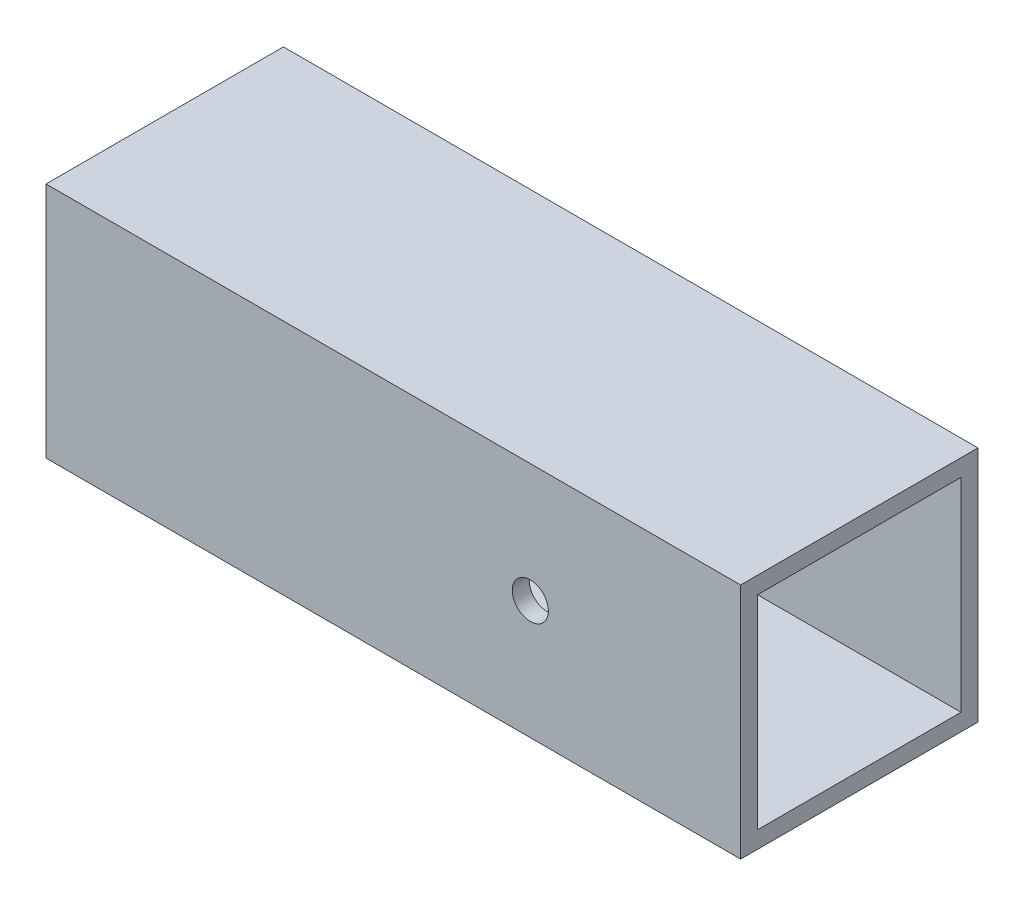
ISO-10303-21;
HEADER;
FILE_DESCRIPTION(('STEP AP214'),'2;1');
FILE_NAME('part.step','',(''),(''),'','','');
FILE_SCHEMA(('AUTOMOTIVE_DESIGN { 1 0 10303 214 1 1 1 1 }'));
ENDSEC;
DATA;
#1=APPLICATION_CONTEXT('core data for automotive mechanical design processes');
#2=APPLICATION_PROTOCOL_DEFINITION('international standard','automotive_design',2000,#1);
#3=PRODUCT_CONTEXT('',#1,'mechanical');
#4=PRODUCT('Part','Part','',(#3));
#5=PRODUCT_RELATED_PRODUCT_CATEGORY('part','',(#4));
#6=PRODUCT_DEFINITION_FORMATION('','',#4);
#7=PRODUCT_DEFINITION_CONTEXT('part definition',#1,'design');
#8=PRODUCT_DEFINITION('design','',#6,#7);
#9=PRODUCT_DEFINITION_SHAPE('','',#8);
#10=(LENGTH_UNIT() NAMED_UNIT(*) SI_UNIT(.MILLI.,.METRE.));
#11=(NAMED_UNIT(*) PLANE_ANGLE_UNIT() SI_UNIT($,.RADIAN.));
#12=(NAMED_UNIT(*) SI_UNIT($,.STERADIAN.) SOLID_ANGLE_UNIT());
#13=UNCERTAINTY_MEASURE_WITH_UNIT(LENGTH_MEASURE(1.E-05),#10,'distance_accuracy_value','');
#14=(GEOMETRIC_REPRESENTATION_CONTEXT(3) GLOBAL_UNCERTAINTY_ASSIGNED_CONTEXT((#13)) GLOBAL_UNIT_ASSIGNED_CONTEXT((#10,
#11,#12)) REPRESENTATION_CONTEXT('',''));
#15=CARTESIAN_POINT('',(0.,0.,0.));
#16=DIRECTION('',(0.,0.,1.));
#17=DIRECTION('',(1.,0.,0.));
#18=AXIS2_PLACEMENT_3D('',#15,#16,#17);
#19=CARTESIAN_POINT('',(130.048,0.,0.));
#20=DIRECTION('',(-1.,0.,0.));
#21=DIRECTION('',(0.,0.,1.));
#22=AXIS2_PLACEMENT_3D('',#19,#20,#21);
#23=PLANE('',#22);
#24=DIRECTION('',(0.,-1.,0.));
#25=VECTOR('',#24,1.);
#26=CARTESIAN_POINT('',(130.048,0.,0.));
#27=LINE('',#26,#25);
#28=CARTESIAN_POINT('',(130.048,44.45,0.));
#29=VERTEX_POINT('',#28);
#30=CARTESIAN_POINT('',(130.048,0.,0.));
#31=VERTEX_POINT('',#30);
#32=EDGE_CURVE('E138',#29,#31,#27,.T.);
#33=ORIENTED_EDGE('',*,*,#32,.T.);
#34=DIRECTION('',(0.,0.,-1.));
#35=VECTOR('',#34,1.);
#36=CARTESIAN_POINT('',(130.048,0.,0.));
#37=LINE('',#36,#35);
#38=CARTESIAN_POINT('',(130.048,0.,-44.45));
#39=VERTEX_POINT('',#38);
#40=EDGE_CURVE('E141',#31,#39,#37,.T.);
#41=ORIENTED_EDGE('',*,*,#40,.T.);
#42=DIRECTION('',(0.,1.,0.));
#43=VECTOR('',#42,1.);
#44=CARTESIAN_POINT('',(130.048,0.,-44.45));
#45=LINE('',#44,#43);
#46=CARTESIAN_POINT('',(130.048,44.45,-44.45));
#47=VERTEX_POINT('',#46);
#48=EDGE_CURVE('E144',#39,#47,#45,.T.);
#49=ORIENTED_EDGE('',*,*,#48,.T.);
#50=DIRECTION('',(0.,0.,1.));
#51=VECTOR('',#50,1.);
#52=CARTESIAN_POINT('',(130.048,44.45,0.));
#53=LINE('',#52,#51);
#54=EDGE_CURVE('E146',#47,#29,#53,.T.);
#55=ORIENTED_EDGE('',*,*,#54,.T.);
#56=EDGE_LOOP('',(#33,#41,#49,#55));
#57=FACE_BOUND('',#56,.T.);
#58=DIRECTION('',(0.,0.,-1.));
#59=VECTOR('',#58,1.);
#60=CARTESIAN_POINT('',(130.048,3.175,-3.175));
#61=LINE('',#60,#59);
#62=CARTESIAN_POINT('',(130.048,3.175,-3.175));
#63=VERTEX_POINT('',#62);
#64=CARTESIAN_POINT('',(130.048,3.175,-41.275));
#65=VERTEX_POINT('',#64);
#66=EDGE_CURVE('E100',#63,#65,#61,.T.);
#67=ORIENTED_EDGE('',*,*,#66,.F.);
#68=DIRECTION('',(0.,-1.,0.));
#69=VECTOR('',#68,1.);
#70=CARTESIAN_POINT('',(130.048,3.175,-3.175));
#71=LINE('',#70,#69);
#72=CARTESIAN_POINT('',(130.048,41.275,-3.175));
#73=VERTEX_POINT('',#72);
#74=EDGE_CURVE('E122',#73,#63,#71,.T.);
#75=ORIENTED_EDGE('',*,*,#74,.F.);
#76=DIRECTION('',(0.,0.,1.));
#77=VECTOR('',#76,1.);
#78=CARTESIAN_POINT('',(130.048,41.275,-3.175));
#79=LINE('',#78,#77);
#80=CARTESIAN_POINT('',(130.048,41.275,-41.275));
#81=VERTEX_POINT('',#80);
#82=EDGE_CURVE('E120',#81,#73,#79,.T.);
#83=ORIENTED_EDGE('',*,*,#82,.F.);
#84=DIRECTION('',(0.,1.,0.));
#85=VECTOR('',#84,1.);
#86=CARTESIAN_POINT('',(130.048,3.175,-41.275));
#87=LINE('',#86,#85);
#88=EDGE_CURVE('E108',#65,#81,#87,.T.);
#89=ORIENTED_EDGE('',*,*,#88,.F.);
#90=EDGE_LOOP('',(#67,#75,#83,#89));
#91=FACE_BOUND('',#90,.T.);
#92=ADVANCED_FACE('F34',(#57,#91),#23,.F.);
#93=CARTESIAN_POINT('',(0.,0.,0.));
#94=DIRECTION('',(-1.,0.,0.));
#95=DIRECTION('',(0.,0.,1.));
#96=AXIS2_PLACEMENT_3D('',#93,#94,#95);
#97=PLANE('',#96);
#98=DIRECTION('',(0.,-1.,0.));
#99=VECTOR('',#98,1.);
#100=CARTESIAN_POINT('',(0.,0.,0.));
#101=LINE('',#100,#99);
#102=CARTESIAN_POINT('',(0.,44.45,0.));
#103=VERTEX_POINT('',#102);
#104=CARTESIAN_POINT('',(0.,0.,0.));
#105=VERTEX_POINT('',#104);
#106=EDGE_CURVE('E116',#103,#105,#101,.T.);
#107=ORIENTED_EDGE('',*,*,#106,.F.);
#108=DIRECTION('',(0.,0.,1.));
#109=VECTOR('',#108,1.);
#110=CARTESIAN_POINT('',(0.,44.45,0.));
#111=LINE('',#110,#109);
#112=CARTESIAN_POINT('',(0.,44.45,-44.45));
#113=VERTEX_POINT('',#112);
#114=EDGE_CURVE('E142',#113,#103,#111,.T.);
#115=ORIENTED_EDGE('',*,*,#114,.F.);
#116=DIRECTION('',(0.,1.,0.));
#117=VECTOR('',#116,1.);
#118=CARTESIAN_POINT('',(0.,0.,-44.45));
#119=LINE('',#118,#117);
#120=CARTESIAN_POINT('',(0.,0.,-44.45));
#121=VERTEX_POINT('',#120);
#122=EDGE_CURVE('E153',#121,#113,#119,.T.);
#123=ORIENTED_EDGE('',*,*,#122,.F.);
#124=DIRECTION('',(0.,0.,-1.));
#125=VECTOR('',#124,1.);
#126=CARTESIAN_POINT('',(0.,0.,0.));
#127=LINE('',#126,#125);
#128=EDGE_CURVE('E151',#105,#121,#127,.T.);
#129=ORIENTED_EDGE('',*,*,#128,.F.);
#130=EDGE_LOOP('',(#107,#115,#123,#129));
#131=FACE_BOUND('',#130,.T.);
#132=DIRECTION('',(0.,-1.,0.));
#133=VECTOR('',#132,1.);
#134=CARTESIAN_POINT('',(0.,3.175,-3.175));
#135=LINE('',#134,#133);
#136=CARTESIAN_POINT('',(0.,41.275,-3.175));
#137=VERTEX_POINT('',#136);
#138=CARTESIAN_POINT('',(0.,3.175,-3.175));
#139=VERTEX_POINT('',#138);
#140=EDGE_CURVE('E109',#137,#139,#135,.T.);
#141=ORIENTED_EDGE('',*,*,#140,.T.);
#142=DIRECTION('',(0.,0.,-1.));
#143=VECTOR('',#142,1.);
#144=CARTESIAN_POINT('',(0.,3.175,-3.175));
#145=LINE('',#144,#143);
#146=CARTESIAN_POINT('',(0.,3.175,-41.275));
#147=VERTEX_POINT('',#146);
#148=EDGE_CURVE('E58',#139,#147,#145,.T.);
#149=ORIENTED_EDGE('',*,*,#148,.T.);
#150=DIRECTION('',(0.,1.,0.));
#151=VECTOR('',#150,1.);
#152=CARTESIAN_POINT('',(0.,3.175,-41.275));
#153=LINE('',#152,#151);
#154=CARTESIAN_POINT('',(0.,41.275,-41.275));
#155=VERTEX_POINT('',#154);
#156=EDGE_CURVE('E115',#147,#155,#153,.T.);
#157=ORIENTED_EDGE('',*,*,#156,.T.);
#158=DIRECTION('',(0.,0.,1.));
#159=VECTOR('',#158,1.);
#160=CARTESIAN_POINT('',(0.,41.275,-3.175));
#161=LINE('',#160,#159);
#162=EDGE_CURVE('E130',#155,#137,#161,.T.);
#163=ORIENTED_EDGE('',*,*,#162,.T.);
#164=EDGE_LOOP('',(#141,#149,#157,#163));
#165=FACE_BOUND('',#164,.T.);
#166=ADVANCED_FACE('F172',(#131,#165),#97,.T.);
#167=CARTESIAN_POINT('',(130.048,0.,0.));
#168=DIRECTION('',(0.,0.,-1.));
#169=DIRECTION('',(-1.,0.,0.));
#170=AXIS2_PLACEMENT_3D('',#167,#168,#169);
#171=PLANE('',#170);
#172=CARTESIAN_POINT('',(90.678,22.225,0.));
#173=DIRECTION('',(0.,0.,1.));
#174=DIRECTION('',(1.,0.,0.));
#175=AXIS2_PLACEMENT_3D('',#172,#173,#174);
#176=CIRCLE('',#175,3.37819999999998);
#177=CARTESIAN_POINT('',(94.0562,22.225,0.));
#178=VERTEX_POINT('',#177);
#179=EDGE_CURVE('E233',#178,#178,#176,.T.);
#180=ORIENTED_EDGE('',*,*,#179,.F.);
#181=EDGE_LOOP('',(#180));
#182=FACE_BOUND('',#181,.T.);
#183=ORIENTED_EDGE('',*,*,#106,.T.);
#184=DIRECTION('',(-1.,0.,0.));
#185=VECTOR('',#184,1.);
#186=CARTESIAN_POINT('',(130.048,0.,0.));
#187=LINE('',#186,#185);
#188=EDGE_CURVE('E11',#31,#105,#187,.T.);
#189=ORIENTED_EDGE('',*,*,#188,.F.);
#190=ORIENTED_EDGE('',*,*,#32,.F.);
#191=DIRECTION('',(-1.,0.,0.));
#192=VECTOR('',#191,1.);
#193=CARTESIAN_POINT('',(130.048,44.45,0.));
#194=LINE('',#193,#192);
#195=EDGE_CURVE('E148',#29,#103,#194,.T.);
#196=ORIENTED_EDGE('',*,*,#195,.T.);
#197=EDGE_LOOP('',(#183,#189,#190,#196));
#198=FACE_BOUND('',#197,.T.);
#199=ADVANCED_FACE('F36',(#182,#198),#171,.F.);
#200=CARTESIAN_POINT('',(130.048,0.,0.));
#201=DIRECTION('',(0.,1.,0.));
#202=DIRECTION('',(0.,0.,1.));
#203=AXIS2_PLACEMENT_3D('',#200,#201,#202);
#204=PLANE('',#203);
#205=ORIENTED_EDGE('',*,*,#128,.T.);
#206=DIRECTION('',(-1.,0.,0.));
#207=VECTOR('',#206,1.);
#208=CARTESIAN_POINT('',(130.048,0.,-44.45));
#209=LINE('',#208,#207);
#210=EDGE_CURVE('E43',#39,#121,#209,.T.);
#211=ORIENTED_EDGE('',*,*,#210,.F.);
#212=ORIENTED_EDGE('',*,*,#40,.F.);
#213=ORIENTED_EDGE('',*,*,#188,.T.);
#214=EDGE_LOOP('',(#205,#211,#212,#213));
#215=FACE_BOUND('',#214,.T.);
#216=ADVANCED_FACE('F182',(#215),#204,.F.);
#217=CARTESIAN_POINT('',(130.048,0.,-44.45));
#218=DIRECTION('',(0.,0.,1.));
#219=DIRECTION('',(1.,0.,0.));
#220=AXIS2_PLACEMENT_3D('',#217,#218,#219);
#221=PLANE('',#220);
#222=CARTESIAN_POINT('',(90.678,22.225,-44.45));
#223=DIRECTION('',(0.,0.,1.));
#224=DIRECTION('',(1.,0.,0.));
#225=AXIS2_PLACEMENT_3D('',#222,#223,#224);
#226=CIRCLE('',#225,3.37819999999998);
#227=CARTESIAN_POINT('',(94.0562,22.225,-44.45));
#228=VERTEX_POINT('',#227);
#229=EDGE_CURVE('E232',#228,#228,#226,.T.);
#230=ORIENTED_EDGE('',*,*,#229,.T.);
#231=EDGE_LOOP('',(#230));
#232=FACE_BOUND('',#231,.T.);
#233=ORIENTED_EDGE('',*,*,#122,.T.);
#234=DIRECTION('',(-1.,0.,0.));
#235=VECTOR('',#234,1.);
#236=CARTESIAN_POINT('',(130.048,44.45,-44.45));
#237=LINE('',#236,#235);
#238=EDGE_CURVE('E158',#47,#113,#237,.T.);
#239=ORIENTED_EDGE('',*,*,#238,.F.);
#240=ORIENTED_EDGE('',*,*,#48,.F.);
#241=ORIENTED_EDGE('',*,*,#210,.T.);
#242=EDGE_LOOP('',(#233,#239,#240,#241));
#243=FACE_BOUND('',#242,.T.);
#244=ADVANCED_FACE('F166',(#232,#243),#221,.F.);
#245=CARTESIAN_POINT('',(130.048,44.45,0.));
#246=DIRECTION('',(0.,-1.,0.));
#247=DIRECTION('',(0.,0.,-1.));
#248=AXIS2_PLACEMENT_3D('',#245,#246,#247);
#249=PLANE('',#248);
#250=ORIENTED_EDGE('',*,*,#114,.T.);
#251=ORIENTED_EDGE('',*,*,#195,.F.);
#252=ORIENTED_EDGE('',*,*,#54,.F.);
#253=ORIENTED_EDGE('',*,*,#238,.T.);
#254=EDGE_LOOP('',(#250,#251,#252,#253));
#255=FACE_BOUND('',#254,.T.);
#256=ADVANCED_FACE('F176',(#255),#249,.F.);
#257=CARTESIAN_POINT('',(130.048,3.175,-3.175));
#258=DIRECTION('',(0.,1.,0.));
#259=DIRECTION('',(0.,0.,1.));
#260=AXIS2_PLACEMENT_3D('',#257,#258,#259);
#261=PLANE('',#260);
#262=ORIENTED_EDGE('',*,*,#148,.F.);
#263=DIRECTION('',(-1.,0.,0.));
#264=VECTOR('',#263,1.);
#265=CARTESIAN_POINT('',(130.048,3.175,-3.175));
#266=LINE('',#265,#264);
#267=EDGE_CURVE('E104',#63,#139,#266,.T.);
#268=ORIENTED_EDGE('',*,*,#267,.F.);
#269=ORIENTED_EDGE('',*,*,#66,.T.);
#270=DIRECTION('',(-1.,0.,0.));
#271=VECTOR('',#270,1.);
#272=CARTESIAN_POINT('',(130.048,3.175,-41.275));
#273=LINE('',#272,#271);
#274=EDGE_CURVE('E103',#65,#147,#273,.T.);
#275=ORIENTED_EDGE('',*,*,#274,.T.);
#276=EDGE_LOOP('',(#262,#268,#269,#275));
#277=FACE_BOUND('',#276,.T.);
#278=ADVANCED_FACE('F102',(#277),#261,.T.);
#279=CARTESIAN_POINT('',(130.048,3.175,-41.275));
#280=DIRECTION('',(0.,0.,1.));
#281=DIRECTION('',(0.,-1.,0.));
#282=AXIS2_PLACEMENT_3D('',#279,#280,#281);
#283=PLANE('',#282);
#284=CARTESIAN_POINT('',(90.678,22.225,-41.275));
#285=DIRECTION('',(0.,0.,1.));
#286=DIRECTION('',(0.,-1.,0.));
#287=AXIS2_PLACEMENT_3D('',#284,#285,#286);
#288=CIRCLE('',#287,3.37819999999998);
#289=CARTESIAN_POINT('',(90.678,18.8468,-41.275));
#290=VERTEX_POINT('',#289);
#291=EDGE_CURVE('E38',#290,#290,#288,.T.);
#292=ORIENTED_EDGE('',*,*,#291,.F.);
#293=EDGE_LOOP('',(#292));
#294=FACE_BOUND('',#293,.T.);
#295=ORIENTED_EDGE('',*,*,#156,.F.);
#296=ORIENTED_EDGE('',*,*,#274,.F.);
#297=ORIENTED_EDGE('',*,*,#88,.T.);
#298=DIRECTION('',(-1.,0.,0.));
#299=VECTOR('',#298,1.);
#300=CARTESIAN_POINT('',(130.048,41.275,-41.275));
#301=LINE('',#300,#299);
#302=EDGE_CURVE('E117',#81,#155,#301,.T.);
#303=ORIENTED_EDGE('',*,*,#302,.T.);
#304=EDGE_LOOP('',(#295,#296,#297,#303));
#305=FACE_BOUND('',#304,.T.);
#306=ADVANCED_FACE('F112',(#294,#305),#283,.T.);
#307=CARTESIAN_POINT('',(130.048,41.275,-3.175));
#308=DIRECTION('',(0.,-1.,0.));
#309=DIRECTION('',(0.,0.,-1.));
#310=AXIS2_PLACEMENT_3D('',#307,#308,#309);
#311=PLANE('',#310);
#312=ORIENTED_EDGE('',*,*,#162,.F.);
#313=ORIENTED_EDGE('',*,*,#302,.F.);
#314=ORIENTED_EDGE('',*,*,#82,.T.);
#315=DIRECTION('',(-1.,0.,0.));
#316=VECTOR('',#315,1.);
#317=CARTESIAN_POINT('',(130.048,41.275,-3.175));
#318=LINE('',#317,#316);
#319=EDGE_CURVE('E50',#73,#137,#318,.T.);
#320=ORIENTED_EDGE('',*,*,#319,.T.);
#321=EDGE_LOOP('',(#312,#313,#314,#320));
#322=FACE_BOUND('',#321,.T.);
#323=ADVANCED_FACE('F207',(#322),#311,.T.);
#324=CARTESIAN_POINT('',(130.048,3.175,-3.175));
#325=DIRECTION('',(0.,0.,-1.));
#326=DIRECTION('',(0.,1.,0.));
#327=AXIS2_PLACEMENT_3D('',#324,#325,#326);
#328=PLANE('',#327);
#329=CARTESIAN_POINT('',(90.678,22.225,-3.175));
#330=DIRECTION('',(0.,0.,-1.));
#331=DIRECTION('',(0.,1.,0.));
#332=AXIS2_PLACEMENT_3D('',#329,#330,#331);
#333=CIRCLE('',#332,3.37819999999998);
#334=CARTESIAN_POINT('',(90.678,25.6032,-3.175));
#335=VERTEX_POINT('',#334);
#336=EDGE_CURVE('E128',#335,#335,#333,.T.);
#337=ORIENTED_EDGE('',*,*,#336,.F.);
#338=EDGE_LOOP('',(#337));
#339=FACE_BOUND('',#338,.T.);
#340=ORIENTED_EDGE('',*,*,#140,.F.);
#341=ORIENTED_EDGE('',*,*,#319,.F.);
#342=ORIENTED_EDGE('',*,*,#74,.T.);
#343=ORIENTED_EDGE('',*,*,#267,.T.);
#344=EDGE_LOOP('',(#340,#341,#342,#343));
#345=FACE_BOUND('',#344,.T.);
#346=ADVANCED_FACE('F212',(#339,#345),#328,.T.);
#347=CARTESIAN_POINT('',(90.678,22.225,0.));
#348=DIRECTION('',(0.,0.,1.));
#349=DIRECTION('',(1.,0.,0.));
#350=AXIS2_PLACEMENT_3D('',#347,#348,#349);
#351=CYLINDRICAL_SURFACE('',#350,3.37819999999998);
#352=ORIENTED_EDGE('',*,*,#291,.T.);
#353=EDGE_LOOP('',(#352));
#354=FACE_BOUND('',#353,.T.);
#355=ORIENTED_EDGE('',*,*,#229,.F.);
#356=EDGE_LOOP('',(#355));
#357=FACE_BOUND('',#356,.T.);
#358=ADVANCED_FACE('F219',(#354,#357),#351,.F.);
#359=ORIENTED_EDGE('',*,*,#336,.T.);
#360=EDGE_LOOP('',(#359));
#361=FACE_BOUND('',#360,.T.);
#362=ORIENTED_EDGE('',*,*,#179,.T.);
#363=EDGE_LOOP('',(#362));
#364=FACE_BOUND('',#363,.T.);
#365=ADVANCED_FACE('F222',(#361,#364),#351,.F.);
#366=CLOSED_SHELL('',(#92,#166,#199,#216,#244,#256,#278,#306,#323,#346,#358,#365));
#367=MANIFOLD_SOLID_BREP('B2',#366);
#368=ADVANCED_BREP_SHAPE_REPRESENTATION('',(#18,#367),#14);
#369=SHAPE_DEFINITION_REPRESENTATION(#9,#368);
ENDSEC;
END-ISO-10303-21;
